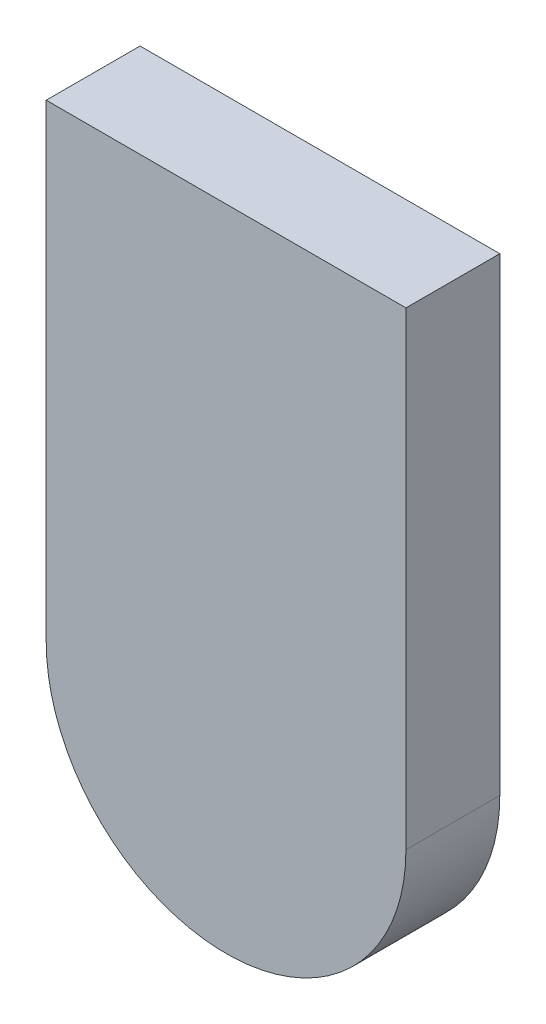
ISO-10303-21;
HEADER;
FILE_DESCRIPTION(('STEP AP214'),'2;1');
FILE_NAME('part.step','',(''),(''),'','','');
FILE_SCHEMA(('AUTOMOTIVE_DESIGN { 1 0 10303 214 1 1 1 1 }'));
ENDSEC;
DATA;
#1=APPLICATION_CONTEXT('core data for automotive mechanical design processes');
#2=APPLICATION_PROTOCOL_DEFINITION('international standard','automotive_design',2000,#1);
#3=PRODUCT_CONTEXT('',#1,'mechanical');
#4=PRODUCT('Part','Part','',(#3));
#5=PRODUCT_RELATED_PRODUCT_CATEGORY('part','',(#4));
#6=PRODUCT_DEFINITION_FORMATION('','',#4);
#7=PRODUCT_DEFINITION_CONTEXT('part definition',#1,'design');
#8=PRODUCT_DEFINITION('design','',#6,#7);
#9=PRODUCT_DEFINITION_SHAPE('','',#8);
#10=(LENGTH_UNIT() NAMED_UNIT(*) SI_UNIT(.MILLI.,.METRE.));
#11=(NAMED_UNIT(*) PLANE_ANGLE_UNIT() SI_UNIT($,.RADIAN.));
#12=(NAMED_UNIT(*) SI_UNIT($,.STERADIAN.) SOLID_ANGLE_UNIT());
#13=UNCERTAINTY_MEASURE_WITH_UNIT(LENGTH_MEASURE(1.E-05),#10,'distance_accuracy_value','');
#14=(GEOMETRIC_REPRESENTATION_CONTEXT(3) GLOBAL_UNCERTAINTY_ASSIGNED_CONTEXT((#13)) GLOBAL_UNIT_ASSIGNED_CONTEXT((#10,
#11,#12)) REPRESENTATION_CONTEXT('',''));
#15=CARTESIAN_POINT('',(0.,0.,0.));
#16=DIRECTION('',(0.,0.,1.));
#17=DIRECTION('',(1.,0.,0.));
#18=AXIS2_PLACEMENT_3D('',#15,#16,#17);
#19=CARTESIAN_POINT('',(0.,0.,6.));
#20=DIRECTION('',(0.,0.,-1.));
#21=DIRECTION('',(-1.,0.,0.));
#22=AXIS2_PLACEMENT_3D('',#19,#20,#21);
#23=CYLINDRICAL_SURFACE('',#22,11.5);
#24=CARTESIAN_POINT('',(0.,0.,0.));
#25=DIRECTION('',(0.,0.,1.));
#26=DIRECTION('',(-1.,0.,0.));
#27=AXIS2_PLACEMENT_3D('',#24,#25,#26);
#28=CIRCLE('',#27,11.5);
#29=CARTESIAN_POINT('',(-11.5,0.,0.));
#30=VERTEX_POINT('',#29);
#31=CARTESIAN_POINT('',(11.5,0.,0.));
#32=VERTEX_POINT('',#31);
#33=EDGE_CURVE('E113',#30,#32,#28,.T.);
#34=ORIENTED_EDGE('',*,*,#33,.T.);
#35=DIRECTION('',(0.,0.,-1.));
#36=VECTOR('',#35,1.);
#37=CARTESIAN_POINT('',(11.5,0.,6.));
#38=LINE('',#37,#36);
#39=CARTESIAN_POINT('',(11.5,0.,6.));
#40=VERTEX_POINT('',#39);
#41=EDGE_CURVE('E11',#40,#32,#38,.T.);
#42=ORIENTED_EDGE('',*,*,#41,.F.);
#43=CARTESIAN_POINT('',(0.,0.,6.));
#44=DIRECTION('',(0.,0.,1.));
#45=DIRECTION('',(-1.,0.,0.));
#46=AXIS2_PLACEMENT_3D('',#43,#44,#45);
#47=CIRCLE('',#46,11.5);
#48=CARTESIAN_POINT('',(-11.5,0.,6.));
#49=VERTEX_POINT('',#48);
#50=EDGE_CURVE('E97',#49,#40,#47,.T.);
#51=ORIENTED_EDGE('',*,*,#50,.F.);
#52=DIRECTION('',(0.,0.,-1.));
#53=VECTOR('',#52,1.);
#54=CARTESIAN_POINT('',(-11.5,0.,6.));
#55=LINE('',#54,#53);
#56=EDGE_CURVE('E109',#49,#30,#55,.T.);
#57=ORIENTED_EDGE('',*,*,#56,.T.);
#58=EDGE_LOOP('',(#34,#42,#51,#57));
#59=FACE_BOUND('',#58,.T.);
#60=ADVANCED_FACE('F45',(#59),#23,.T.);
#61=CARTESIAN_POINT('',(11.5,30.,6.));
#62=DIRECTION('',(-1.,0.,0.));
#63=DIRECTION('',(0.,-1.,0.));
#64=AXIS2_PLACEMENT_3D('',#61,#62,#63);
#65=PLANE('',#64);
#66=DIRECTION('',(0.,1.,0.));
#67=VECTOR('',#66,1.);
#68=CARTESIAN_POINT('',(11.5,30.,0.));
#69=LINE('',#68,#67);
#70=CARTESIAN_POINT('',(11.5,30.,0.));
#71=VERTEX_POINT('',#70);
#72=EDGE_CURVE('E102',#32,#71,#69,.T.);
#73=ORIENTED_EDGE('',*,*,#72,.T.);
#74=DIRECTION('',(0.,0.,-1.));
#75=VECTOR('',#74,1.);
#76=CARTESIAN_POINT('',(11.5,30.,6.));
#77=LINE('',#76,#75);
#78=CARTESIAN_POINT('',(11.5,30.,6.));
#79=VERTEX_POINT('',#78);
#80=EDGE_CURVE('E54',#79,#71,#77,.T.);
#81=ORIENTED_EDGE('',*,*,#80,.F.);
#82=DIRECTION('',(0.,1.,0.));
#83=VECTOR('',#82,1.);
#84=CARTESIAN_POINT('',(11.5,30.,6.));
#85=LINE('',#84,#83);
#86=EDGE_CURVE('E92',#40,#79,#85,.T.);
#87=ORIENTED_EDGE('',*,*,#86,.F.);
#88=ORIENTED_EDGE('',*,*,#41,.T.);
#89=EDGE_LOOP('',(#73,#81,#87,#88));
#90=FACE_BOUND('',#89,.T.);
#91=ADVANCED_FACE('F101',(#90),#65,.F.);
#92=CARTESIAN_POINT('',(-11.5,30.,6.));
#93=DIRECTION('',(0.,-1.,0.));
#94=DIRECTION('',(0.,0.,-1.));
#95=AXIS2_PLACEMENT_3D('',#92,#93,#94);
#96=PLANE('',#95);
#97=DIRECTION('',(-1.,0.,0.));
#98=VECTOR('',#97,1.);
#99=CARTESIAN_POINT('',(-11.5,30.,0.));
#100=LINE('',#99,#98);
#101=CARTESIAN_POINT('',(-11.5,30.,0.));
#102=VERTEX_POINT('',#101);
#103=EDGE_CURVE('E79',#71,#102,#100,.T.);
#104=ORIENTED_EDGE('',*,*,#103,.T.);
#105=DIRECTION('',(0.,0.,-1.));
#106=VECTOR('',#105,1.);
#107=CARTESIAN_POINT('',(-11.5,30.,6.));
#108=LINE('',#107,#106);
#109=CARTESIAN_POINT('',(-11.5,30.,6.));
#110=VERTEX_POINT('',#109);
#111=EDGE_CURVE('E104',#110,#102,#108,.T.);
#112=ORIENTED_EDGE('',*,*,#111,.F.);
#113=DIRECTION('',(-1.,0.,0.));
#114=VECTOR('',#113,1.);
#115=CARTESIAN_POINT('',(-11.5,30.,6.));
#116=LINE('',#115,#114);
#117=EDGE_CURVE('E95',#79,#110,#116,.T.);
#118=ORIENTED_EDGE('',*,*,#117,.F.);
#119=ORIENTED_EDGE('',*,*,#80,.T.);
#120=EDGE_LOOP('',(#104,#112,#118,#119));
#121=FACE_BOUND('',#120,.T.);
#122=ADVANCED_FACE('F105',(#121),#96,.F.);
#123=CARTESIAN_POINT('',(-11.5,30.,6.));
#124=DIRECTION('',(1.,0.,0.));
#125=DIRECTION('',(0.,1.,0.));
#126=AXIS2_PLACEMENT_3D('',#123,#124,#125);
#127=PLANE('',#126);
#128=DIRECTION('',(0.,-1.,0.));
#129=VECTOR('',#128,1.);
#130=CARTESIAN_POINT('',(-11.5,30.,0.));
#131=LINE('',#130,#129);
#132=EDGE_CURVE('E85',#102,#30,#131,.T.);
#133=ORIENTED_EDGE('',*,*,#132,.T.);
#134=ORIENTED_EDGE('',*,*,#56,.F.);
#135=DIRECTION('',(0.,-1.,0.));
#136=VECTOR('',#135,1.);
#137=CARTESIAN_POINT('',(-11.5,30.,6.));
#138=LINE('',#137,#136);
#139=EDGE_CURVE('E62',#110,#49,#138,.T.);
#140=ORIENTED_EDGE('',*,*,#139,.F.);
#141=ORIENTED_EDGE('',*,*,#111,.T.);
#142=EDGE_LOOP('',(#133,#134,#140,#141));
#143=FACE_BOUND('',#142,.T.);
#144=ADVANCED_FACE('F126',(#143),#127,.F.);
#145=CARTESIAN_POINT('',(0.,0.,6.));
#146=DIRECTION('',(0.,0.,-1.));
#147=DIRECTION('',(-1.,0.,0.));
#148=AXIS2_PLACEMENT_3D('',#145,#146,#147);
#149=PLANE('',#148);
#150=ORIENTED_EDGE('',*,*,#50,.T.);
#151=ORIENTED_EDGE('',*,*,#86,.T.);
#152=ORIENTED_EDGE('',*,*,#117,.T.);
#153=ORIENTED_EDGE('',*,*,#139,.T.);
#154=EDGE_LOOP('',(#150,#151,#152,#153));
#155=FACE_BOUND('',#154,.T.);
#156=ADVANCED_FACE('F93',(#155),#149,.F.);
#157=CARTESIAN_POINT('',(0.,0.,0.));
#158=DIRECTION('',(0.,0.,-1.));
#159=DIRECTION('',(-1.,0.,0.));
#160=AXIS2_PLACEMENT_3D('',#157,#158,#159);
#161=PLANE('',#160);
#162=ORIENTED_EDGE('',*,*,#33,.F.);
#163=ORIENTED_EDGE('',*,*,#132,.F.);
#164=ORIENTED_EDGE('',*,*,#103,.F.);
#165=ORIENTED_EDGE('',*,*,#72,.F.);
#166=EDGE_LOOP('',(#162,#163,#164,#165));
#167=FACE_BOUND('',#166,.T.);
#168=ADVANCED_FACE('F129',(#167),#161,.T.);
#169=CLOSED_SHELL('',(#60,#91,#122,#144,#156,#168));
#170=MANIFOLD_SOLID_BREP('B2',#169);
#171=ADVANCED_BREP_SHAPE_REPRESENTATION('',(#18,#170),#14);
#172=SHAPE_DEFINITION_REPRESENTATION(#9,#171);
ENDSEC;
END-ISO-10303-21;
